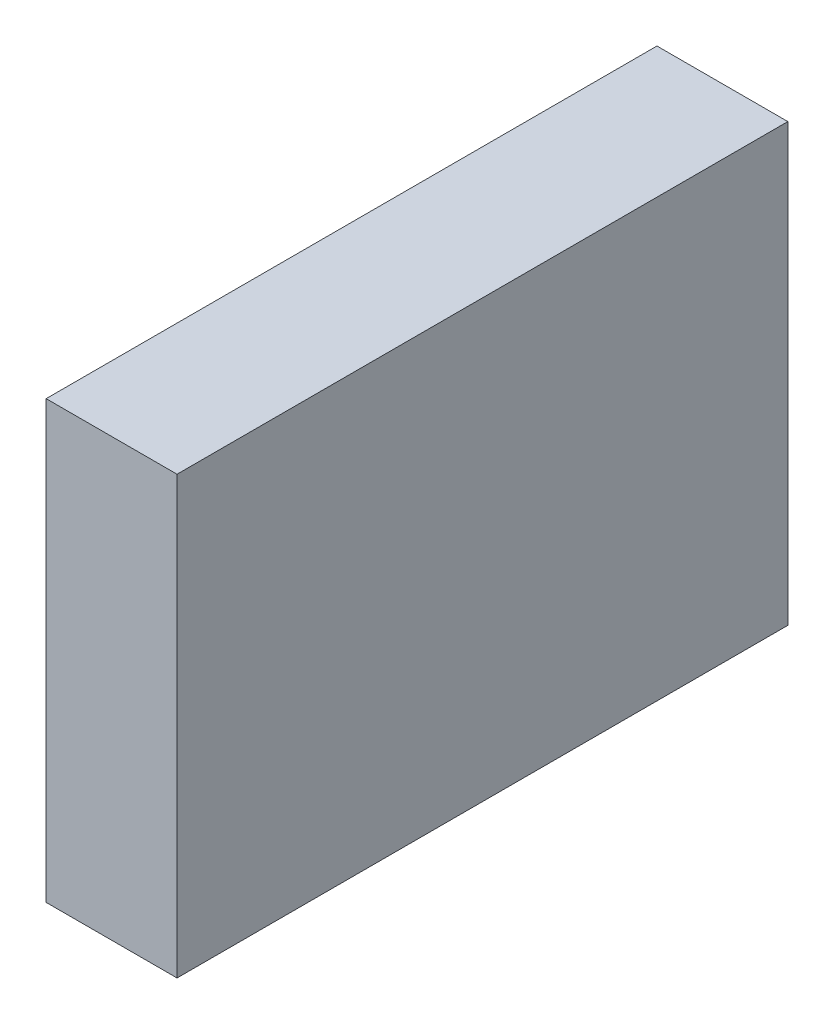
ISO-10303-21;
HEADER;
FILE_DESCRIPTION(('STEP AP214'),'2;1');
FILE_NAME('part.step','',(''),(''),'','','');
FILE_SCHEMA(('AUTOMOTIVE_DESIGN { 1 0 10303 214 1 1 1 1 }'));
ENDSEC;
DATA;
#1=APPLICATION_CONTEXT('core data for automotive mechanical design processes');
#2=APPLICATION_PROTOCOL_DEFINITION('international standard','automotive_design',2000,#1);
#3=PRODUCT_CONTEXT('',#1,'mechanical');
#4=PRODUCT('Part','Part','',(#3));
#5=PRODUCT_RELATED_PRODUCT_CATEGORY('part','',(#4));
#6=PRODUCT_DEFINITION_FORMATION('','',#4);
#7=PRODUCT_DEFINITION_CONTEXT('part definition',#1,'design');
#8=PRODUCT_DEFINITION('design','',#6,#7);
#9=PRODUCT_DEFINITION_SHAPE('','',#8);
#10=(LENGTH_UNIT() NAMED_UNIT(*) SI_UNIT(.MILLI.,.METRE.));
#11=(NAMED_UNIT(*) PLANE_ANGLE_UNIT() SI_UNIT($,.RADIAN.));
#12=(NAMED_UNIT(*) SI_UNIT($,.STERADIAN.) SOLID_ANGLE_UNIT());
#13=UNCERTAINTY_MEASURE_WITH_UNIT(LENGTH_MEASURE(1.E-05),#10,'distance_accuracy_value','');
#14=(GEOMETRIC_REPRESENTATION_CONTEXT(3) GLOBAL_UNCERTAINTY_ASSIGNED_CONTEXT((#13)) GLOBAL_UNIT_ASSIGNED_CONTEXT((#10,
#11,#12)) REPRESENTATION_CONTEXT('',''));
#15=CARTESIAN_POINT('',(0.,0.,0.));
#16=DIRECTION('',(0.,0.,1.));
#17=DIRECTION('',(1.,0.,0.));
#18=AXIS2_PLACEMENT_3D('',#15,#16,#17);
#19=CARTESIAN_POINT('',(3.90000011889494,0.679999140633106,-3.72112146154861));
#20=DIRECTION('',(1.,-1.74845553146952E-07,0.));
#21=DIRECTION('',(1.74845553146952E-07,1.,8.74227765734759E-08));
#22=AXIS2_PLACEMENT_3D('',#19,#20,#21);
#23=PLANE('',#22);
#24=DIRECTION('',(0.,-8.74227766369168E-08,0.999999999999996));
#25=VECTOR('',#24,1.);
#26=CARTESIAN_POINT('',(3.90000030597969,1.74999913451451,-3.65112136800624));
#27=LINE('',#26,#25);
#28=CARTESIAN_POINT('',(3.90000030597969,1.74999913451451,-3.65112136800523));
#29=VERTEX_POINT('',#28);
#30=CARTESIAN_POINT('',(3.90000030597966,1.74999901212162,-2.25112136800623));
#31=VERTEX_POINT('',#30);
#32=EDGE_CURVE('E11',#29,#31,#27,.T.);
#33=ORIENTED_EDGE('',*,*,#32,.F.);
#34=DIRECTION('',(1.74845553146599E-07,0.999999999999981,8.74227765732993E-08));
#35=VECTOR('',#34,1.);
#36=CARTESIAN_POINT('',(3.90000013113413,0.749999134512512,-3.65112145542901));
#37=LINE('',#36,#35);
#38=CARTESIAN_POINT('',(3.90000013113413,0.749999134513512,-3.65112145542901));
#39=VERTEX_POINT('',#38);
#40=EDGE_CURVE('E59',#39,#29,#37,.T.);
#41=ORIENTED_EDGE('',*,*,#40,.F.);
#42=DIRECTION('',(0.,8.74227765576152E-08,-0.999999999999996));
#43=VECTOR('',#42,1.);
#44=CARTESIAN_POINT('',(3.90000013113411,0.749999012120625,-2.25112145542901));
#45=LINE('',#44,#43);
#46=CARTESIAN_POINT('',(3.90000013113411,0.749999012120625,-2.25112145543001));
#47=VERTEX_POINT('',#46);
#48=EDGE_CURVE('E79',#47,#39,#45,.T.);
#49=ORIENTED_EDGE('',*,*,#48,.F.);
#50=DIRECTION('',(-1.74845553146599E-07,-0.999999999999981,-8.74227765732993E-08));
#51=VECTOR('',#50,1.);
#52=CARTESIAN_POINT('',(3.90000030597966,1.74999901212262,-2.25112136800623));
#53=LINE('',#52,#51);
#54=EDGE_CURVE('E84',#31,#47,#53,.T.);
#55=ORIENTED_EDGE('',*,*,#54,.F.);
#56=EDGE_LOOP('',(#33,#41,#49,#55));
#57=FACE_BOUND('',#56,.T.);
#58=ADVANCED_FACE('F17',(#57),#23,.F.);
#59=CARTESIAN_POINT('',(4.20000011889495,0.67999908817944,-3.72112146154861));
#60=DIRECTION('',(1.,-1.74845553146952E-07,0.));
#61=DIRECTION('',(1.74845553146952E-07,1.,8.74227765734759E-08));
#62=AXIS2_PLACEMENT_3D('',#59,#60,#61);
#63=PLANE('',#62);
#64=DIRECTION('',(-1.74845553146599E-07,-0.999999999999981,-8.74227765732993E-08));
#65=VECTOR('',#64,1.);
#66=CARTESIAN_POINT('',(4.20000030597966,1.74999895966896,-2.25112136800623));
#67=LINE('',#66,#65);
#68=CARTESIAN_POINT('',(4.20000030597966,1.74999895966796,-2.25112136800623));
#69=VERTEX_POINT('',#68);
#70=CARTESIAN_POINT('',(4.20000013113411,0.749998959666959,-2.25112145543001));
#71=VERTEX_POINT('',#70);
#72=EDGE_CURVE('E24',#69,#71,#67,.T.);
#73=ORIENTED_EDGE('',*,*,#72,.T.);
#74=DIRECTION('',(0.,8.74227765576152E-08,-0.999999999999996));
#75=VECTOR('',#74,1.);
#76=CARTESIAN_POINT('',(4.20000013113411,0.749998959666959,-2.25112145542901));
#77=LINE('',#76,#75);
#78=CARTESIAN_POINT('',(4.20000013113413,0.749999082059846,-3.65112145542901));
#79=VERTEX_POINT('',#78);
#80=EDGE_CURVE('E82',#71,#79,#77,.T.);
#81=ORIENTED_EDGE('',*,*,#80,.T.);
#82=DIRECTION('',(1.74845553146599E-07,0.999999999999981,8.74227765732994E-08));
#83=VECTOR('',#82,1.);
#84=CARTESIAN_POINT('',(4.20000013113413,0.749999082058846,-3.65112145542901));
#85=LINE('',#84,#83);
#86=CARTESIAN_POINT('',(4.20000030597969,1.74999908206085,-3.65112136800523));
#87=VERTEX_POINT('',#86);
#88=EDGE_CURVE('E64',#79,#87,#85,.T.);
#89=ORIENTED_EDGE('',*,*,#88,.T.);
#90=DIRECTION('',(0.,-8.74227764783136E-08,0.999999999999996));
#91=VECTOR('',#90,1.);
#92=CARTESIAN_POINT('',(4.20000030597969,1.74999908206085,-3.65112136800623));
#93=LINE('',#92,#91);
#94=EDGE_CURVE('E61',#87,#69,#93,.T.);
#95=ORIENTED_EDGE('',*,*,#94,.T.);
#96=EDGE_LOOP('',(#73,#81,#89,#95));
#97=FACE_BOUND('',#96,.T.);
#98=ADVANCED_FACE('F62',(#97),#63,.T.);
#99=CARTESIAN_POINT('',(3.90000030597966,1.74999901212262,-2.25112136800623));
#100=DIRECTION('',(0.,-8.74227765734759E-08,1.));
#101=DIRECTION('',(-1.74845553146952E-07,-1.,-8.74227765734759E-08));
#102=AXIS2_PLACEMENT_3D('',#99,#100,#101);
#103=PLANE('',#102);
#104=ORIENTED_EDGE('',*,*,#54,.T.);
#105=DIRECTION('',(0.999999999999985,-1.74845553220963E-07,0.));
#106=VECTOR('',#105,1.);
#107=CARTESIAN_POINT('',(3.90000013113411,0.749999012120625,-2.25112145542901));
#108=LINE('',#107,#106);
#109=EDGE_CURVE('E57',#47,#71,#108,.T.);
#110=ORIENTED_EDGE('',*,*,#109,.T.);
#111=ORIENTED_EDGE('',*,*,#72,.F.);
#112=DIRECTION('',(0.999999999999985,-1.74845552850889E-07,0.));
#113=VECTOR('',#112,1.);
#114=CARTESIAN_POINT('',(3.90000030597966,1.74999901212262,-2.25112136800623));
#115=LINE('',#114,#113);
#116=EDGE_CURVE('E55',#31,#69,#115,.T.);
#117=ORIENTED_EDGE('',*,*,#116,.F.);
#118=EDGE_LOOP('',(#104,#110,#111,#117));
#119=FACE_BOUND('',#118,.T.);
#120=ADVANCED_FACE('F53',(#119),#103,.T.);
#121=CARTESIAN_POINT('',(3.90000013113411,0.749999012120625,-2.25112145542901));
#122=DIRECTION('',(-1.74845553146952E-07,-1.,-8.74227765734759E-08));
#123=DIRECTION('',(0.,8.74227765734759E-08,-1.));
#124=AXIS2_PLACEMENT_3D('',#121,#122,#123);
#125=PLANE('',#124);
#126=ORIENTED_EDGE('',*,*,#48,.T.);
#127=DIRECTION('',(0.999999999999985,-1.74845553220963E-07,0.));
#128=VECTOR('',#127,1.);
#129=CARTESIAN_POINT('',(3.90000013113413,0.749999134512512,-3.65112145542901));
#130=LINE('',#129,#128);
#131=EDGE_CURVE('E68',#39,#79,#130,.T.);
#132=ORIENTED_EDGE('',*,*,#131,.T.);
#133=ORIENTED_EDGE('',*,*,#80,.F.);
#134=ORIENTED_EDGE('',*,*,#109,.F.);
#135=EDGE_LOOP('',(#126,#132,#133,#134));
#136=FACE_BOUND('',#135,.T.);
#137=ADVANCED_FACE('F91',(#136),#125,.T.);
#138=CARTESIAN_POINT('',(3.90000013113413,0.749999134512512,-3.65112145542901));
#139=DIRECTION('',(0.,8.74227765734759E-08,-1.));
#140=DIRECTION('',(1.74845553146952E-07,1.,8.74227765734759E-08));
#141=AXIS2_PLACEMENT_3D('',#138,#139,#140);
#142=PLANE('',#141);
#143=ORIENTED_EDGE('',*,*,#40,.T.);
#144=DIRECTION('',(0.999999999999985,-1.74845552850889E-07,0.));
#145=VECTOR('',#144,1.);
#146=CARTESIAN_POINT('',(3.90000030597969,1.74999913451451,-3.65112136800623));
#147=LINE('',#146,#145);
#148=EDGE_CURVE('E69',#29,#87,#147,.T.);
#149=ORIENTED_EDGE('',*,*,#148,.T.);
#150=ORIENTED_EDGE('',*,*,#88,.F.);
#151=ORIENTED_EDGE('',*,*,#131,.F.);
#152=EDGE_LOOP('',(#143,#149,#150,#151));
#153=FACE_BOUND('',#152,.T.);
#154=ADVANCED_FACE('F88',(#153),#142,.T.);
#155=CARTESIAN_POINT('',(3.90000030597969,1.74999913451451,-3.65112136800623));
#156=DIRECTION('',(1.74845553146952E-07,1.,8.74227765734759E-08));
#157=DIRECTION('',(0.,-8.74227765734759E-08,1.));
#158=AXIS2_PLACEMENT_3D('',#155,#156,#157);
#159=PLANE('',#158);
#160=ORIENTED_EDGE('',*,*,#32,.T.);
#161=ORIENTED_EDGE('',*,*,#116,.T.);
#162=ORIENTED_EDGE('',*,*,#94,.F.);
#163=ORIENTED_EDGE('',*,*,#148,.F.);
#164=EDGE_LOOP('',(#160,#161,#162,#163));
#165=FACE_BOUND('',#164,.T.);
#166=ADVANCED_FACE('F71',(#165),#159,.T.);
#167=CLOSED_SHELL('',(#58,#98,#120,#137,#154,#166));
#168=MANIFOLD_SOLID_BREP('B1',#167);
#169=ADVANCED_BREP_SHAPE_REPRESENTATION('',(#18,#168),#14);
#170=SHAPE_DEFINITION_REPRESENTATION(#9,#169);
ENDSEC;
END-ISO-10303-21;
